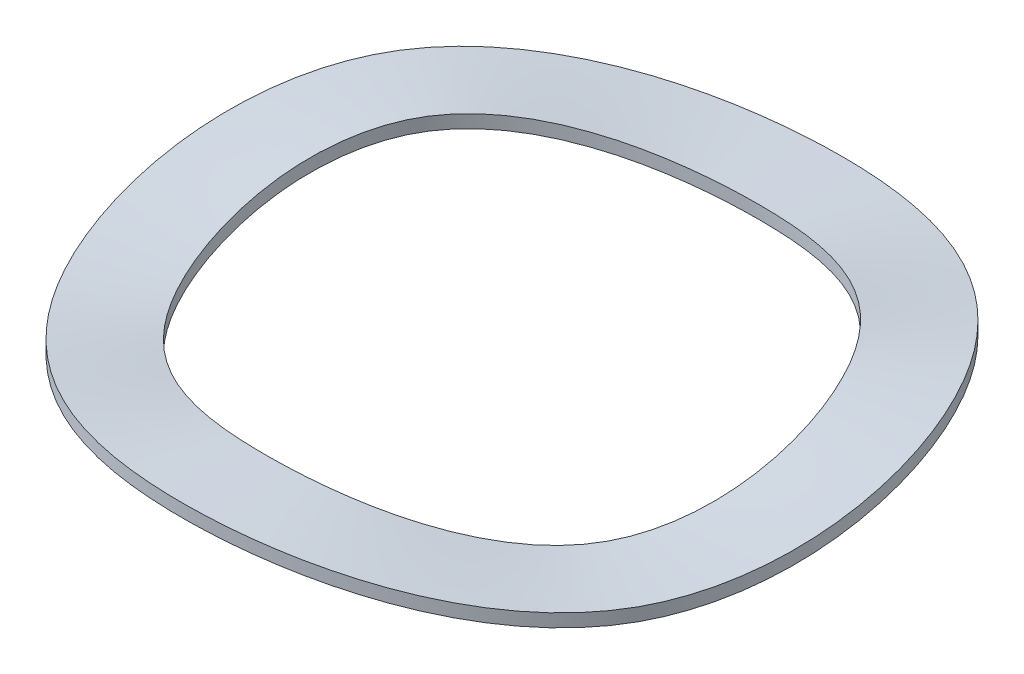
ISO-10303-21;
HEADER;
FILE_DESCRIPTION(('STEP AP214'),'2;1');
FILE_NAME('part.step','',(''),(''),'','','');
FILE_SCHEMA(('AUTOMOTIVE_DESIGN { 1 0 10303 214 1 1 1 1 }'));
ENDSEC;
DATA;
#1=APPLICATION_CONTEXT('core data for automotive mechanical design processes');
#2=APPLICATION_PROTOCOL_DEFINITION('international standard','automotive_design',2000,#1);
#3=PRODUCT_CONTEXT('',#1,'mechanical');
#4=PRODUCT('Part','Part','',(#3));
#5=PRODUCT_RELATED_PRODUCT_CATEGORY('part','',(#4));
#6=PRODUCT_DEFINITION_FORMATION('','',#4);
#7=PRODUCT_DEFINITION_CONTEXT('part definition',#1,'design');
#8=PRODUCT_DEFINITION('design','',#6,#7);
#9=PRODUCT_DEFINITION_SHAPE('','',#8);
#10=(LENGTH_UNIT() NAMED_UNIT(*) SI_UNIT(.MILLI.,.METRE.));
#11=(NAMED_UNIT(*) PLANE_ANGLE_UNIT() SI_UNIT($,.RADIAN.));
#12=(NAMED_UNIT(*) SI_UNIT($,.STERADIAN.) SOLID_ANGLE_UNIT());
#13=UNCERTAINTY_MEASURE_WITH_UNIT(LENGTH_MEASURE(1.E-05),#10,'distance_accuracy_value','');
#14=(GEOMETRIC_REPRESENTATION_CONTEXT(3) GLOBAL_UNCERTAINTY_ASSIGNED_CONTEXT((#13)) GLOBAL_UNIT_ASSIGNED_CONTEXT((#10,
#11,#12)) REPRESENTATION_CONTEXT('',''));
#15=CARTESIAN_POINT('',(0.,0.,0.));
#16=DIRECTION('',(0.,0.,1.));
#17=DIRECTION('',(1.,0.,0.));
#18=AXIS2_PLACEMENT_3D('',#15,#16,#17);
#19=CARTESIAN_POINT('',(0.,0.508,-12.9032));
#20=CARTESIAN_POINT('',(4.46979959604454,0.508,-12.9032));
#21=CARTESIAN_POINT('',(13.4093987881337,2.8956,-7.74192));
#22=CARTESIAN_POINT('',(13.4093987881336,-0.685799999999999,7.74192000000004));
#23=CARTESIAN_POINT('',(0.,2.8956,15.48384));
#24=CARTESIAN_POINT('',(-13.4093987881337,-0.685799999999999,7.74191999999995));
#25=CARTESIAN_POINT('',(-13.4093987881336,1.7018,-2.58064000000006));
#26=CARTESIAN_POINT('',(-8.93959919208905,1.7018,-10.32256));
#27=CARTESIAN_POINT('',(-4.46979959604454,0.508,-12.9032));
#28=CARTESIAN_POINT('',(0.,0.508,-12.9032));
#29=CARTESIAN_POINT('',(0.,0.508,-11.8194666666667));
#30=CARTESIAN_POINT('',(4.09438335700668,0.508,-11.8194666666666));
#31=CARTESIAN_POINT('',(12.2831500710201,2.8956,-7.09168));
#32=CARTESIAN_POINT('',(12.28315007102,-0.6858,7.09168000000004));
#33=CARTESIAN_POINT('',(0.,2.8956,14.18336));
#34=CARTESIAN_POINT('',(-12.2831500710201,-0.685800000000002,7.09167999999996));
#35=CARTESIAN_POINT('',(-12.28315007102,1.7018,-2.36389333333339));
#36=CARTESIAN_POINT('',(-8.18876671401333,1.7018,-9.45557333333338));
#37=CARTESIAN_POINT('',(-4.09438335700668,0.508,-11.8194666666667));
#38=CARTESIAN_POINT('',(0.,0.508,-11.8194666666667));
#39=CARTESIAN_POINT('',(0.,0.508,-10.7357333333333));
#40=CARTESIAN_POINT('',(3.71896711796882,0.508,-10.7357333333333));
#41=CARTESIAN_POINT('',(11.1569013539065,2.8956,-6.44144));
#42=CARTESIAN_POINT('',(11.1569013539064,-0.6858,6.44144000000003));
#43=CARTESIAN_POINT('',(0.,2.8956,12.88288));
#44=CARTESIAN_POINT('',(-11.1569013539065,-0.685800000000006,6.44143999999996));
#45=CARTESIAN_POINT('',(-11.1569013539064,1.7018,-2.14714666666672));
#46=CARTESIAN_POINT('',(-7.43793423593761,1.7018,-8.58858666666671));
#47=CARTESIAN_POINT('',(-3.71896711796882,0.508,-10.7357333333333));
#48=CARTESIAN_POINT('',(0.,0.508,-10.7357333333333));
#49=CARTESIAN_POINT('',(0.,0.508,-9.652));
#50=CARTESIAN_POINT('',(3.34355087893096,0.507999999999999,-9.65199999999999));
#51=CARTESIAN_POINT('',(10.0306526367929,2.8956,-5.7912));
#52=CARTESIAN_POINT('',(10.0306526367929,-0.685800000000001,5.79120000000003));
#53=CARTESIAN_POINT('',(0.,2.8956,11.5824));
#54=CARTESIAN_POINT('',(-10.0306526367929,-0.685800000000009,5.79119999999997));
#55=CARTESIAN_POINT('',(-10.0306526367929,1.7018,-1.93040000000004));
#56=CARTESIAN_POINT('',(-6.68710175786189,1.7018,-7.72160000000004));
#57=CARTESIAN_POINT('',(-3.34355087893096,0.508,-9.65200000000001));
#58=CARTESIAN_POINT('',(0.,0.508,-9.652));
#59=B_SPLINE_SURFACE_WITH_KNOTS('',3,3,((#19,#20,#21,#22,#23,#24,#25,#26,#27,#28),(#29,#30,#31,
#32,#33,#34,#35,#36,#37,#38),(#39,#40,#41,#42,#43,#44,#45,#46,#47,#48),(#49,#50,#51,#52,#53,#54,
#55,#56,#57,#58)),.UNSPECIFIED.,.F.,.T.,.F.,(4,4),(4,1,1,1,1,2,4),(0.,1.),(0.,0.166666666666667,
0.333333333333334,0.5,0.666666666666666,0.833333333333333,1.),.UNSPECIFIED.);
#60=CARTESIAN_POINT('',(0.,0.508,-12.9032));
#61=CARTESIAN_POINT('',(4.46979959604454,0.508,-12.9032));
#62=CARTESIAN_POINT('',(13.4093987881337,2.8956,-7.74192));
#63=CARTESIAN_POINT('',(13.4093987881336,-0.685799999999999,7.74192000000004));
#64=CARTESIAN_POINT('',(0.,2.8956,15.48384));
#65=CARTESIAN_POINT('',(-13.4093987881337,-0.685799999999999,7.74191999999995));
#66=CARTESIAN_POINT('',(-13.4093987881336,1.7018,-2.58064000000006));
#67=CARTESIAN_POINT('',(-8.93959919208905,1.7018,-10.32256));
#68=CARTESIAN_POINT('',(-4.46979959604454,0.508,-12.9032));
#69=CARTESIAN_POINT('',(0.,0.508,-12.9032));
#70=B_SPLINE_CURVE_WITH_KNOTS('',3,(#60,#61,#62,#63,#64,#65,#66,#67,#68,#69),.UNSPECIFIED.,.T.,
.F.,(4,1,1,1,1,2,4),(0.,0.166666666666667,0.333333333333334,0.5,0.666666666666666,
0.833333333333333,1.),.UNSPECIFIED.);
#71=CARTESIAN_POINT('',(0.,0.508,-12.9032));
#72=VERTEX_POINT('',#71);
#73=EDGE_CURVE('E32',#72,#72,#70,.T.);
#74=CARTESIAN_POINT('',(0.,0.508,-9.652));
#75=CARTESIAN_POINT('',(3.34355087893096,0.507999999999999,-9.65199999999999));
#76=CARTESIAN_POINT('',(10.0306526367929,2.8956,-5.7912));
#77=CARTESIAN_POINT('',(10.0306526367929,-0.685800000000001,5.79120000000003));
#78=CARTESIAN_POINT('',(0.,2.8956,11.5824));
#79=CARTESIAN_POINT('',(-10.0306526367929,-0.68580000000001,5.79119999999997));
#80=CARTESIAN_POINT('',(-10.0306526367929,1.7018,-1.93040000000004));
#81=CARTESIAN_POINT('',(-6.68710175786189,1.7018,-7.72160000000004));
#82=CARTESIAN_POINT('',(-3.34355087893096,0.508,-9.65200000000001));
#83=CARTESIAN_POINT('',(0.,0.508,-9.652));
#84=B_SPLINE_CURVE_WITH_KNOTS('',3,(#74,#75,#76,#77,#78,#79,#80,#81,#82,#83),.UNSPECIFIED.,.T.,
.F.,(4,1,1,1,1,2,4),(0.,0.166666666666667,0.333333333333334,0.5,0.666666666666666,
0.833333333333333,1.),.UNSPECIFIED.);
#85=CARTESIAN_POINT('',(0.,0.508,-9.652));
#86=VERTEX_POINT('',#85);
#87=EDGE_CURVE('E21',#86,#86,#84,.F.);
#88=ORIENTED_EDGE('',*,*,#73,.F.);
#89=EDGE_LOOP('',(#88));
#90=FACE_BOUND('',#89,.T.);
#91=ORIENTED_EDGE('',*,*,#87,.F.);
#92=EDGE_LOOP('',(#91));
#93=FACE_BOUND('',#92,.T.);
#94=ADVANCED_FACE('F15',(#90,#93),#59,.T.);
#95=CARTESIAN_POINT('',(0.,0.508,-9.652));
#96=CARTESIAN_POINT('',(3.34355087893096,0.507999999999999,-9.65199999999999));
#97=CARTESIAN_POINT('',(10.0306526367929,2.8956,-5.7912));
#98=CARTESIAN_POINT('',(10.0306526367929,-0.685800000000001,5.79120000000003));
#99=CARTESIAN_POINT('',(0.,2.8956,11.5824));
#100=CARTESIAN_POINT('',(-10.0306526367929,-0.68580000000001,5.79119999999997));
#101=CARTESIAN_POINT('',(-10.0306526367929,1.7018,-1.93040000000004));
#102=CARTESIAN_POINT('',(-6.68710175786189,1.7018,-7.72160000000004));
#103=CARTESIAN_POINT('',(-3.34355087893096,0.508,-9.65200000000001));
#104=CARTESIAN_POINT('',(0.,0.508,-9.652));
#105=CARTESIAN_POINT('',(0.,0.338666666666667,-9.652));
#106=CARTESIAN_POINT('',(3.34355087893096,0.338666666666666,-9.65199999999999));
#107=CARTESIAN_POINT('',(10.0306526367929,2.72626666666667,-5.7912));
#108=CARTESIAN_POINT('',(10.0306526367929,-0.855133333333333,5.79120000000003));
#109=CARTESIAN_POINT('',(0.,2.72626666666667,11.5824));
#110=CARTESIAN_POINT('',(-10.0306526367929,-0.855133333333339,5.79119999999997));
#111=CARTESIAN_POINT('',(-10.0306526367929,1.53246666666666,-1.93040000000004));
#112=CARTESIAN_POINT('',(-6.68710175786189,1.53246666666667,-7.72160000000004));
#113=CARTESIAN_POINT('',(-3.34355087893096,0.338666666666667,-9.65200000000001));
#114=CARTESIAN_POINT('',(0.,0.338666666666667,-9.652));
#115=CARTESIAN_POINT('',(0.,0.169333333333333,-9.652));
#116=CARTESIAN_POINT('',(3.34355087893096,0.169333333333333,-9.65199999999999));
#117=CARTESIAN_POINT('',(10.0306526367929,2.55693333333334,-5.7912));
#118=CARTESIAN_POINT('',(10.0306526367929,-1.02446666666667,5.79120000000003));
#119=CARTESIAN_POINT('',(0.,2.55693333333333,11.5824));
#120=CARTESIAN_POINT('',(-10.0306526367929,-1.02446666666667,5.79119999999997));
#121=CARTESIAN_POINT('',(-10.0306526367929,1.36313333333333,-1.93040000000004));
#122=CARTESIAN_POINT('',(-6.68710175786189,1.36313333333334,-7.72160000000004));
#123=CARTESIAN_POINT('',(-3.34355087893096,0.169333333333334,-9.65200000000001));
#124=CARTESIAN_POINT('',(0.,0.169333333333333,-9.652));
#125=CARTESIAN_POINT('',(0.,0.,-9.652));
#126=CARTESIAN_POINT('',(3.34355087893096,0.,-9.65199999999999));
#127=CARTESIAN_POINT('',(10.0306526367929,2.3876,-5.7912));
#128=CARTESIAN_POINT('',(10.0306526367929,-1.1938,5.79120000000003));
#129=CARTESIAN_POINT('',(0.,2.3876,11.5824));
#130=CARTESIAN_POINT('',(-10.0306526367929,-1.1938,5.79119999999997));
#131=CARTESIAN_POINT('',(-10.0306526367929,1.1938,-1.93040000000004));
#132=CARTESIAN_POINT('',(-6.68710175786189,1.1938,-7.72160000000004));
#133=CARTESIAN_POINT('',(-3.34355087893096,0.,-9.65200000000001));
#134=CARTESIAN_POINT('',(0.,0.,-9.652));
#135=B_SPLINE_SURFACE_WITH_KNOTS('',3,3,((#95,#96,#97,#98,#99,#100,#101,#102,#103,#104),(#105,
#106,#107,#108,#109,#110,#111,#112,#113,#114),(#115,#116,#117,#118,#119,#120,#121,#122,#123,
#124),(#125,#126,#127,#128,#129,#130,#131,#132,#133,#134)),.UNSPECIFIED.,.F.,.T.,.F.,(4,4),(4,1,
1,1,1,2,4),(0.,1.),(0.,0.166666666666667,0.333333333333334,0.5,0.666666666666666,
0.833333333333333,1.),.UNSPECIFIED.);
#136=CARTESIAN_POINT('',(0.,0.,-9.652));
#137=CARTESIAN_POINT('',(3.34355087893096,0.,-9.65199999999999));
#138=CARTESIAN_POINT('',(10.0306526367929,2.3876,-5.7912));
#139=CARTESIAN_POINT('',(10.0306526367929,-1.1938,5.79120000000003));
#140=CARTESIAN_POINT('',(0.,2.3876,11.5824));
#141=CARTESIAN_POINT('',(-10.0306526367929,-1.1938,5.79119999999997));
#142=CARTESIAN_POINT('',(-10.0306526367929,1.1938,-1.93040000000004));
#143=CARTESIAN_POINT('',(-6.68710175786189,1.1938,-7.72160000000004));
#144=CARTESIAN_POINT('',(-3.34355087893096,0.,-9.65200000000001));
#145=CARTESIAN_POINT('',(0.,0.,-9.652));
#146=B_SPLINE_CURVE_WITH_KNOTS('',3,(#136,#137,#138,#139,#140,#141,#142,#143,#144,#145),
.UNSPECIFIED.,.T.,.F.,(4,1,1,1,1,2,4),(0.,0.166666666666667,0.333333333333334,0.5,
0.666666666666666,0.833333333333333,1.),.UNSPECIFIED.);
#147=CARTESIAN_POINT('',(0.,0.,-9.652));
#148=VERTEX_POINT('',#147);
#149=EDGE_CURVE('E27',#148,#148,#146,.F.);
#150=ORIENTED_EDGE('',*,*,#87,.T.);
#151=EDGE_LOOP('',(#150));
#152=FACE_BOUND('',#151,.T.);
#153=ORIENTED_EDGE('',*,*,#149,.F.);
#154=EDGE_LOOP('',(#153));
#155=FACE_BOUND('',#154,.T.);
#156=ADVANCED_FACE('F55',(#152,#155),#135,.T.);
#157=CARTESIAN_POINT('',(0.,0.,-12.9032));
#158=CARTESIAN_POINT('',(4.46979959604454,0.,-12.9032));
#159=CARTESIAN_POINT('',(13.4093987881337,2.3876,-7.74192));
#160=CARTESIAN_POINT('',(13.4093987881336,-1.1938,7.74192000000004));
#161=CARTESIAN_POINT('',(0.,2.3876,15.48384));
#162=CARTESIAN_POINT('',(-13.4093987881337,-1.1938,7.74191999999995));
#163=CARTESIAN_POINT('',(-13.4093987881336,1.1938,-2.58064000000006));
#164=CARTESIAN_POINT('',(-8.93959919208905,1.1938,-10.32256));
#165=CARTESIAN_POINT('',(-4.46979959604454,0.,-12.9032));
#166=CARTESIAN_POINT('',(0.,0.,-12.9032));
#167=CARTESIAN_POINT('',(0.,0.169333333333333,-12.9032));
#168=CARTESIAN_POINT('',(4.46979959604454,0.169333333333334,-12.9032));
#169=CARTESIAN_POINT('',(13.4093987881337,2.55693333333333,-7.74192));
#170=CARTESIAN_POINT('',(13.4093987881336,-1.02446666666667,7.74192000000004));
#171=CARTESIAN_POINT('',(0.,2.55693333333333,15.48384));
#172=CARTESIAN_POINT('',(-13.4093987881337,-1.02446666666667,7.74191999999995));
#173=CARTESIAN_POINT('',(-13.4093987881336,1.36313333333333,-2.58064000000006));
#174=CARTESIAN_POINT('',(-8.93959919208905,1.36313333333334,-10.32256));
#175=CARTESIAN_POINT('',(-4.46979959604454,0.169333333333333,-12.9032));
#176=CARTESIAN_POINT('',(0.,0.169333333333333,-12.9032));
#177=CARTESIAN_POINT('',(0.,0.338666666666667,-12.9032));
#178=CARTESIAN_POINT('',(4.46979959604454,0.338666666666667,-12.9032));
#179=CARTESIAN_POINT('',(13.4093987881337,2.72626666666667,-7.74192));
#180=CARTESIAN_POINT('',(13.4093987881336,-0.855133333333332,7.74192000000004));
#181=CARTESIAN_POINT('',(0.,2.72626666666666,15.48384));
#182=CARTESIAN_POINT('',(-13.4093987881337,-0.855133333333332,7.74191999999995));
#183=CARTESIAN_POINT('',(-13.4093987881336,1.53246666666666,-2.58064000000006));
#184=CARTESIAN_POINT('',(-8.93959919208905,1.53246666666667,-10.32256));
#185=CARTESIAN_POINT('',(-4.46979959604454,0.338666666666667,-12.9032));
#186=CARTESIAN_POINT('',(0.,0.338666666666667,-12.9032));
#187=CARTESIAN_POINT('',(0.,0.508,-12.9032));
#188=CARTESIAN_POINT('',(4.46979959604454,0.508,-12.9032));
#189=CARTESIAN_POINT('',(13.4093987881337,2.8956,-7.74192));
#190=CARTESIAN_POINT('',(13.4093987881336,-0.685799999999999,7.74192000000004));
#191=CARTESIAN_POINT('',(0.,2.8956,15.48384));
#192=CARTESIAN_POINT('',(-13.4093987881337,-0.685799999999999,7.74191999999995));
#193=CARTESIAN_POINT('',(-13.4093987881336,1.7018,-2.58064000000006));
#194=CARTESIAN_POINT('',(-8.93959919208905,1.7018,-10.32256));
#195=CARTESIAN_POINT('',(-4.46979959604454,0.508,-12.9032));
#196=CARTESIAN_POINT('',(0.,0.508,-12.9032));
#197=B_SPLINE_SURFACE_WITH_KNOTS('',3,3,((#157,#158,#159,#160,#161,#162,#163,#164,#165,#166),
(#167,#168,#169,#170,#171,#172,#173,#174,#175,#176),(#177,#178,#179,#180,#181,#182,#183,#184,
#185,#186),(#187,#188,#189,#190,#191,#192,#193,#194,#195,#196)),.UNSPECIFIED.,.F.,.T.,.F.,(4,4),
(4,1,1,1,1,2,4),(0.,1.),(0.,0.166666666666667,0.333333333333334,0.5,0.666666666666666,
0.833333333333333,1.),.UNSPECIFIED.);
#198=CARTESIAN_POINT('',(0.,0.,-12.9032));
#199=CARTESIAN_POINT('',(4.46979959604454,0.,-12.9032));
#200=CARTESIAN_POINT('',(13.4093987881337,2.3876,-7.74192));
#201=CARTESIAN_POINT('',(13.4093987881336,-1.1938,7.74192000000004));
#202=CARTESIAN_POINT('',(0.,2.3876,15.48384));
#203=CARTESIAN_POINT('',(-13.4093987881337,-1.1938,7.74191999999995));
#204=CARTESIAN_POINT('',(-13.4093987881336,1.1938,-2.58064000000006));
#205=CARTESIAN_POINT('',(-8.93959919208905,1.1938,-10.32256));
#206=CARTESIAN_POINT('',(-4.46979959604454,0.,-12.9032));
#207=CARTESIAN_POINT('',(0.,0.,-12.9032));
#208=B_SPLINE_CURVE_WITH_KNOTS('',3,(#198,#199,#200,#201,#202,#203,#204,#205,#206,#207),
.UNSPECIFIED.,.T.,.F.,(4,1,1,1,1,2,4),(0.,0.166666666666667,0.333333333333334,0.5,
0.666666666666666,0.833333333333333,1.),.UNSPECIFIED.);
#209=CARTESIAN_POINT('',(0.,0.,-12.9032));
#210=VERTEX_POINT('',#209);
#211=EDGE_CURVE('E10',#210,#210,#208,.T.);
#212=ORIENTED_EDGE('',*,*,#73,.T.);
#213=EDGE_LOOP('',(#212));
#214=FACE_BOUND('',#213,.T.);
#215=ORIENTED_EDGE('',*,*,#211,.F.);
#216=EDGE_LOOP('',(#215));
#217=FACE_BOUND('',#216,.T.);
#218=ADVANCED_FACE('F65',(#214,#217),#197,.T.);
#219=CARTESIAN_POINT('',(0.,0.,-9.652));
#220=CARTESIAN_POINT('',(3.34355087893096,0.,-9.65199999999999));
#221=CARTESIAN_POINT('',(10.0306526367929,2.3876,-5.7912));
#222=CARTESIAN_POINT('',(10.0306526367929,-1.1938,5.79120000000003));
#223=CARTESIAN_POINT('',(0.,2.3876,11.5824));
#224=CARTESIAN_POINT('',(-10.0306526367929,-1.1938,5.79119999999997));
#225=CARTESIAN_POINT('',(-10.0306526367929,1.1938,-1.93040000000004));
#226=CARTESIAN_POINT('',(-6.68710175786189,1.1938,-7.72160000000004));
#227=CARTESIAN_POINT('',(-3.34355087893096,0.,-9.65200000000001));
#228=CARTESIAN_POINT('',(0.,0.,-9.652));
#229=CARTESIAN_POINT('',(0.,0.,-10.7357333333333));
#230=CARTESIAN_POINT('',(3.71896711796882,0.,-10.7357333333333));
#231=CARTESIAN_POINT('',(11.1569013539065,2.3876,-6.44144));
#232=CARTESIAN_POINT('',(11.1569013539064,-1.1938,6.44144000000003));
#233=CARTESIAN_POINT('',(0.,2.3876,12.88288));
#234=CARTESIAN_POINT('',(-11.1569013539065,-1.1938,6.44143999999996));
#235=CARTESIAN_POINT('',(-11.1569013539064,1.1938,-2.14714666666672));
#236=CARTESIAN_POINT('',(-7.43793423593761,1.1938,-8.58858666666671));
#237=CARTESIAN_POINT('',(-3.71896711796882,0.,-10.7357333333333));
#238=CARTESIAN_POINT('',(0.,0.,-10.7357333333333));
#239=CARTESIAN_POINT('',(0.,0.,-11.8194666666667));
#240=CARTESIAN_POINT('',(4.09438335700668,0.,-11.8194666666666));
#241=CARTESIAN_POINT('',(12.2831500710201,2.3876,-7.09168));
#242=CARTESIAN_POINT('',(12.28315007102,-1.1938,7.09168000000004));
#243=CARTESIAN_POINT('',(0.,2.3876,14.18336));
#244=CARTESIAN_POINT('',(-12.2831500710201,-1.1938,7.09167999999996));
#245=CARTESIAN_POINT('',(-12.28315007102,1.1938,-2.36389333333339));
#246=CARTESIAN_POINT('',(-8.18876671401334,1.1938,-9.45557333333338));
#247=CARTESIAN_POINT('',(-4.09438335700668,0.,-11.8194666666667));
#248=CARTESIAN_POINT('',(0.,0.,-11.8194666666667));
#249=CARTESIAN_POINT('',(0.,0.,-12.9032));
#250=CARTESIAN_POINT('',(4.46979959604454,0.,-12.9032));
#251=CARTESIAN_POINT('',(13.4093987881337,2.3876,-7.74192));
#252=CARTESIAN_POINT('',(13.4093987881336,-1.1938,7.74192000000004));
#253=CARTESIAN_POINT('',(0.,2.3876,15.48384));
#254=CARTESIAN_POINT('',(-13.4093987881337,-1.1938,7.74191999999995));
#255=CARTESIAN_POINT('',(-13.4093987881336,1.1938,-2.58064000000006));
#256=CARTESIAN_POINT('',(-8.93959919208905,1.1938,-10.32256));
#257=CARTESIAN_POINT('',(-4.46979959604454,0.,-12.9032));
#258=CARTESIAN_POINT('',(0.,0.,-12.9032));
#259=B_SPLINE_SURFACE_WITH_KNOTS('',3,3,((#219,#220,#221,#222,#223,#224,#225,#226,#227,#228),
(#229,#230,#231,#232,#233,#234,#235,#236,#237,#238),(#239,#240,#241,#242,#243,#244,#245,#246,
#247,#248),(#249,#250,#251,#252,#253,#254,#255,#256,#257,#258)),.UNSPECIFIED.,.F.,.T.,.F.,(4,4),
(4,1,1,1,1,2,4),(0.,1.),(0.,0.166666666666667,0.333333333333334,0.5,0.666666666666666,
0.833333333333333,1.),.UNSPECIFIED.);
#260=ORIENTED_EDGE('',*,*,#149,.T.);
#261=EDGE_LOOP('',(#260));
#262=FACE_BOUND('',#261,.T.);
#263=ORIENTED_EDGE('',*,*,#211,.T.);
#264=EDGE_LOOP('',(#263));
#265=FACE_BOUND('',#264,.T.);
#266=ADVANCED_FACE('F17',(#262,#265),#259,.T.);
#267=CLOSED_SHELL('',(#94,#156,#218,#266));
#268=MANIFOLD_SOLID_BREP('B1',#267);
#269=ADVANCED_BREP_SHAPE_REPRESENTATION('',(#18,#268),#14);
#270=SHAPE_DEFINITION_REPRESENTATION(#9,#269);
ENDSEC;
END-ISO-10303-21;
